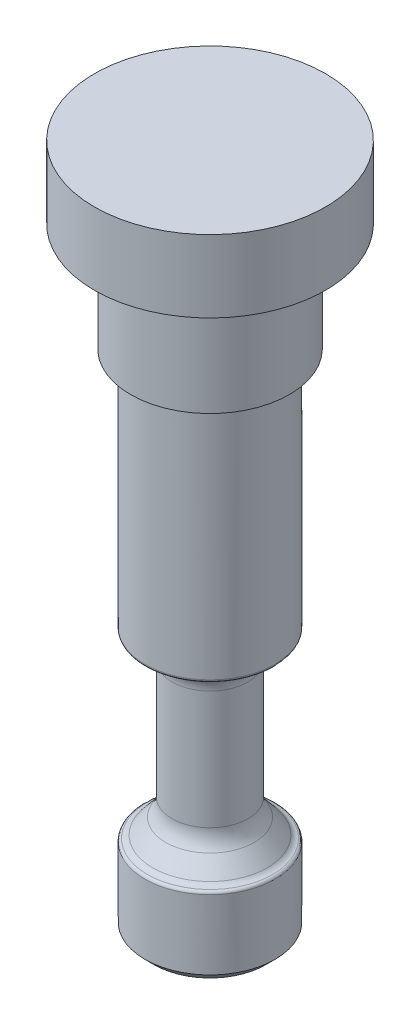
ISO-10303-21;
HEADER;
FILE_DESCRIPTION(('STEP AP214'),'2;1');
FILE_NAME('part.step','',(''),(''),'','','');
FILE_SCHEMA(('AUTOMOTIVE_DESIGN { 1 0 10303 214 1 1 1 1 }'));
ENDSEC;
DATA;
#1=APPLICATION_CONTEXT('core data for automotive mechanical design processes');
#2=APPLICATION_PROTOCOL_DEFINITION('international standard','automotive_design',2000,#1);
#3=PRODUCT_CONTEXT('',#1,'mechanical');
#4=PRODUCT('Part','Part','',(#3));
#5=PRODUCT_RELATED_PRODUCT_CATEGORY('part','',(#4));
#6=PRODUCT_DEFINITION_FORMATION('','',#4);
#7=PRODUCT_DEFINITION_CONTEXT('part definition',#1,'design');
#8=PRODUCT_DEFINITION('design','',#6,#7);
#9=PRODUCT_DEFINITION_SHAPE('','',#8);
#10=(LENGTH_UNIT() NAMED_UNIT(*) SI_UNIT(.MILLI.,.METRE.));
#11=(NAMED_UNIT(*) PLANE_ANGLE_UNIT() SI_UNIT($,.RADIAN.));
#12=(NAMED_UNIT(*) SI_UNIT($,.STERADIAN.) SOLID_ANGLE_UNIT());
#13=UNCERTAINTY_MEASURE_WITH_UNIT(LENGTH_MEASURE(1.E-05),#10,'distance_accuracy_value','');
#14=(GEOMETRIC_REPRESENTATION_CONTEXT(3) GLOBAL_UNCERTAINTY_ASSIGNED_CONTEXT((#13)) GLOBAL_UNIT_ASSIGNED_CONTEXT((#10,
#11,#12)) REPRESENTATION_CONTEXT('',''));
#15=CARTESIAN_POINT('',(0.,0.,0.));
#16=DIRECTION('',(0.,0.,1.));
#17=DIRECTION('',(1.,0.,0.));
#18=AXIS2_PLACEMENT_3D('',#15,#16,#17);
#19=CARTESIAN_POINT('',(0.,44.45,0.));
#20=DIRECTION('',(0.,-1.,0.));
#21=DIRECTION('',(0.,0.,-1.));
#22=AXIS2_PLACEMENT_3D('',#19,#20,#21);
#23=CYLINDRICAL_SURFACE('',#22,5.715);
#24=CARTESIAN_POINT('',(0.,6.90528775559072,0.));
#25=DIRECTION('',(0.,-1.,0.));
#26=DIRECTION('',(0.,0.,-1.));
#27=AXIS2_PLACEMENT_3D('',#24,#25,#26);
#28=CIRCLE('',#27,5.715);
#29=CARTESIAN_POINT('',(0.,6.90528775559072,-5.715));
#30=VERTEX_POINT('',#29);
#31=EDGE_CURVE('E53',#30,#30,#28,.T.);
#32=ORIENTED_EDGE('',*,*,#31,.T.);
#33=EDGE_LOOP('',(#32));
#34=FACE_BOUND('',#33,.T.);
#35=CARTESIAN_POINT('',(0.,0.793750000000003,0.));
#36=DIRECTION('',(0.,1.,0.));
#37=DIRECTION('',(0.,0.,1.));
#38=AXIS2_PLACEMENT_3D('',#35,#36,#37);
#39=CIRCLE('',#38,5.715);
#40=CARTESIAN_POINT('',(0.,0.793750000000003,5.715));
#41=VERTEX_POINT('',#40);
#42=EDGE_CURVE('E62',#41,#41,#39,.T.);
#43=ORIENTED_EDGE('',*,*,#42,.T.);
#44=EDGE_LOOP('',(#43));
#45=FACE_BOUND('',#44,.T.);
#46=ADVANCED_FACE('F33',(#34,#45),#23,.T.);
#47=CARTESIAN_POINT('',(0.,0.,0.));
#48=DIRECTION('',(0.,1.,0.));
#49=DIRECTION('',(0.,0.,1.));
#50=AXIS2_PLACEMENT_3D('',#47,#48,#49);
#51=PLANE('',#50);
#52=CARTESIAN_POINT('',(0.,0.,0.));
#53=DIRECTION('',(0.,1.,0.));
#54=DIRECTION('',(0.,0.,1.));
#55=AXIS2_PLACEMENT_3D('',#52,#53,#54);
#56=CIRCLE('',#55,4.92124999999999);
#57=CARTESIAN_POINT('',(0.,0.,4.92124999999999));
#58=VERTEX_POINT('',#57);
#59=EDGE_CURVE('E59',#58,#58,#56,.F.);
#60=ORIENTED_EDGE('',*,*,#59,.T.);
#61=EDGE_LOOP('',(#60));
#62=FACE_BOUND('',#61,.T.);
#63=ADVANCED_FACE('F109',(#62),#51,.F.);
#64=CARTESIAN_POINT('',(0.,0.793750000000003,0.));
#65=DIRECTION('',(0.,1.,0.));
#66=DIRECTION('',(0.,0.,1.));
#67=AXIS2_PLACEMENT_3D('',#64,#65,#66);
#68=CONICAL_SURFACE('',#67,5.715,0.785398163397452);
#69=ORIENTED_EDGE('',*,*,#59,.F.);
#70=EDGE_LOOP('',(#69));
#71=FACE_BOUND('',#70,.T.);
#72=ORIENTED_EDGE('',*,*,#42,.F.);
#73=EDGE_LOOP('',(#72));
#74=FACE_BOUND('',#73,.T.);
#75=ADVANCED_FACE('F116',(#71,#74),#68,.T.);
#76=CARTESIAN_POINT('',(0.,10.31875,0.));
#77=DIRECTION('',(0.,1.,0.));
#78=DIRECTION('',(0.,0.,1.));
#79=AXIS2_PLACEMENT_3D('',#76,#77,#78);
#80=TOROIDAL_SURFACE('',#79,5.715,2.38125);
#81=CARTESIAN_POINT('',(0.,8.78811200443393,0.));
#82=DIRECTION('',(0.,1.,0.));
#83=DIRECTION('',(0.,0.,1.));
#84=AXIS2_PLACEMENT_3D('',#81,#82,#83);
#85=CIRCLE('',#84,3.89085666982293);
#86=CARTESIAN_POINT('',(0.,8.78811200443393,3.89085666982293));
#87=VERTEX_POINT('',#86);
#88=EDGE_CURVE('E68',#87,#87,#85,.T.);
#89=ORIENTED_EDGE('',*,*,#88,.T.);
#90=EDGE_LOOP('',(#89));
#91=FACE_BOUND('',#90,.T.);
#92=CARTESIAN_POINT('',(0.,10.31875,0.));
#93=DIRECTION('',(0.,1.,0.));
#94=DIRECTION('',(0.,0.,1.));
#95=AXIS2_PLACEMENT_3D('',#92,#93,#94);
#96=CIRCLE('',#95,3.33375);
#97=CARTESIAN_POINT('',(0.,10.31875,3.33375));
#98=VERTEX_POINT('',#97);
#99=EDGE_CURVE('E77',#98,#98,#96,.T.);
#100=ORIENTED_EDGE('',*,*,#99,.F.);
#101=EDGE_LOOP('',(#100));
#102=FACE_BOUND('',#101,.T.);
#103=ADVANCED_FACE('F162',(#91,#102),#80,.F.);
#104=CARTESIAN_POINT('',(0.,8.78811200443393,0.));
#105=DIRECTION('',(0.,-1.,0.));
#106=DIRECTION('',(0.,0.,-1.));
#107=AXIS2_PLACEMENT_3D('',#104,#105,#106);
#108=CONICAL_SURFACE('',#107,3.89085666982293,0.698131700797733);
#109=CARTESIAN_POINT('',(0.,7.42728733481131,0.));
#110=DIRECTION('',(0.,1.,0.));
#111=DIRECTION('',(0.,0.,1.));
#112=AXIS2_PLACEMENT_3D('',#109,#110,#111);
#113=CIRCLE('',#112,5.03272414820022);
#114=CARTESIAN_POINT('',(0.,7.42728733481131,5.03272414820022));
#115=VERTEX_POINT('',#114);
#116=EDGE_CURVE('E71',#115,#115,#113,.T.);
#117=ORIENTED_EDGE('',*,*,#116,.T.);
#118=EDGE_LOOP('',(#117));
#119=FACE_BOUND('',#118,.T.);
#120=ORIENTED_EDGE('',*,*,#88,.F.);
#121=EDGE_LOOP('',(#120));
#122=FACE_BOUND('',#121,.T.);
#123=ADVANCED_FACE('F158',(#119,#122),#108,.T.);
#124=CARTESIAN_POINT('',(0.,7.9375,0.));
#125=DIRECTION('',(0.,1.,0.));
#126=DIRECTION('',(0.,0.,1.));
#127=AXIS2_PLACEMENT_3D('',#124,#125,#126);
#128=TOROIDAL_SURFACE('',#127,5.64077192492591,0.793750000000001);
#129=CARTESIAN_POINT('',(0.,7.15552102696271,0.));
#130=DIRECTION('',(0.,1.,0.));
#131=DIRECTION('',(0.,0.,1.));
#132=AXIS2_PLACEMENT_3D('',#129,#130,#131);
#133=CIRCLE('',#132,5.50458107270932);
#134=CARTESIAN_POINT('',(0.,7.15552102696271,5.50458107270932));
#135=VERTEX_POINT('',#134);
#136=EDGE_CURVE('E56',#135,#135,#133,.T.);
#137=ORIENTED_EDGE('',*,*,#136,.T.);
#138=EDGE_LOOP('',(#137));
#139=FACE_BOUND('',#138,.T.);
#140=ORIENTED_EDGE('',*,*,#116,.F.);
#141=EDGE_LOOP('',(#140));
#142=FACE_BOUND('',#141,.T.);
#143=ADVANCED_FACE('F154',(#139,#142),#128,.F.);
#144=CARTESIAN_POINT('',(0.,20.73275,0.));
#145=DIRECTION('',(0.,1.,0.));
#146=DIRECTION('',(0.,0.,1.));
#147=AXIS2_PLACEMENT_3D('',#144,#145,#146);
#148=TOROIDAL_SURFACE('',#147,5.61975,2.286);
#149=CARTESIAN_POINT('',(0.,23.0142807875142,0.));
#150=DIRECTION('',(0.,-1.,0.));
#151=DIRECTION('',(0.,0.,-1.));
#152=AXIS2_PLACEMENT_3D('',#149,#150,#151);
#153=CIRCLE('',#152,5.476875);
#154=CARTESIAN_POINT('',(0.,23.0142807875142,-5.476875));
#155=VERTEX_POINT('',#154);
#156=EDGE_CURVE('E44',#155,#155,#153,.T.);
#157=ORIENTED_EDGE('',*,*,#156,.T.);
#158=EDGE_LOOP('',(#157));
#159=FACE_BOUND('',#158,.T.);
#160=CARTESIAN_POINT('',(0.,20.73275,0.));
#161=DIRECTION('',(0.,1.,0.));
#162=DIRECTION('',(0.,0.,1.));
#163=AXIS2_PLACEMENT_3D('',#160,#161,#162);
#164=CIRCLE('',#163,3.33375);
#165=CARTESIAN_POINT('',(0.,20.73275,3.33375));
#166=VERTEX_POINT('',#165);
#167=EDGE_CURVE('E74',#166,#166,#164,.T.);
#168=ORIENTED_EDGE('',*,*,#167,.T.);
#169=EDGE_LOOP('',(#168));
#170=FACE_BOUND('',#169,.T.);
#171=ADVANCED_FACE('F132',(#159,#170),#148,.F.);
#172=CARTESIAN_POINT('',(0.,44.45,0.));
#173=DIRECTION('',(0.,1.,0.));
#174=DIRECTION('',(0.,0.,1.));
#175=AXIS2_PLACEMENT_3D('',#172,#173,#174);
#176=CYLINDRICAL_SURFACE('',#175,3.33375);
#177=ORIENTED_EDGE('',*,*,#167,.F.);
#178=EDGE_LOOP('',(#177));
#179=FACE_BOUND('',#178,.T.);
#180=ORIENTED_EDGE('',*,*,#99,.T.);
#181=EDGE_LOOP('',(#180));
#182=FACE_BOUND('',#181,.T.);
#183=ADVANCED_FACE('F123',(#179,#182),#176,.T.);
#184=CARTESIAN_POINT('',(0.,23.2677842083491,0.));
#185=DIRECTION('',(0.,-1.,0.));
#186=DIRECTION('',(0.,0.,-1.));
#187=AXIS2_PLACEMENT_3D('',#184,#185,#186);
#188=CIRCLE('',#187,5.715);
#189=CARTESIAN_POINT('',(0.,23.2677842083491,-5.715));
#190=VERTEX_POINT('',#189);
#191=EDGE_CURVE('E48',#190,#190,#188,.F.);
#192=ORIENTED_EDGE('',*,*,#191,.T.);
#193=EDGE_LOOP('',(#192));
#194=FACE_BOUND('',#193,.T.);
#195=CARTESIAN_POINT('',(0.,44.45,0.));
#196=DIRECTION('',(0.,1.,0.));
#197=DIRECTION('',(0.,0.,1.));
#198=AXIS2_PLACEMENT_3D('',#195,#196,#197);
#199=CIRCLE('',#198,5.715);
#200=CARTESIAN_POINT('',(0.,44.45,5.715));
#201=VERTEX_POINT('',#200);
#202=EDGE_CURVE('E65',#201,#201,#199,.T.);
#203=ORIENTED_EDGE('',*,*,#202,.F.);
#204=EDGE_LOOP('',(#203));
#205=FACE_BOUND('',#204,.T.);
#206=ADVANCED_FACE('F112',(#194,#205),#23,.T.);
#207=CARTESIAN_POINT('',(0.,6.90528775559072,0.));
#208=DIRECTION('',(0.,-1.,0.));
#209=DIRECTION('',(0.,0.,-1.));
#210=AXIS2_PLACEMENT_3D('',#207,#208,#209);
#211=TOROIDAL_SURFACE('',#210,5.461,0.254);
#212=ORIENTED_EDGE('',*,*,#31,.F.);
#213=EDGE_LOOP('',(#212));
#214=FACE_BOUND('',#213,.T.);
#215=ORIENTED_EDGE('',*,*,#136,.F.);
#216=EDGE_LOOP('',(#215));
#217=FACE_BOUND('',#216,.T.);
#218=ADVANCED_FACE('F122',(#214,#217),#211,.T.);
#219=CARTESIAN_POINT('',(0.,23.2677842083491,0.));
#220=DIRECTION('',(0.,-1.,0.));
#221=DIRECTION('',(0.,0.,-1.));
#222=AXIS2_PLACEMENT_3D('',#219,#220,#221);
#223=TOROIDAL_SURFACE('',#222,5.461,0.254);
#224=ORIENTED_EDGE('',*,*,#156,.F.);
#225=EDGE_LOOP('',(#224));
#226=FACE_BOUND('',#225,.T.);
#227=ORIENTED_EDGE('',*,*,#191,.F.);
#228=EDGE_LOOP('',(#227));
#229=FACE_BOUND('',#228,.T.);
#230=ADVANCED_FACE('F129',(#226,#229),#223,.T.);
#231=CARTESIAN_POINT('',(0.,53.975,0.));
#232=DIRECTION('',(0.,-1.,0.));
#233=DIRECTION('',(0.,0.,-1.));
#234=AXIS2_PLACEMENT_3D('',#231,#232,#233);
#235=CYLINDRICAL_SURFACE('',#234,6.985);
#236=CARTESIAN_POINT('',(0.,52.705,0.));
#237=DIRECTION('',(0.,1.,0.));
#238=DIRECTION('',(0.,0.,1.));
#239=AXIS2_PLACEMENT_3D('',#236,#237,#238);
#240=CIRCLE('',#239,6.985);
#241=CARTESIAN_POINT('',(0.,52.705,6.985));
#242=VERTEX_POINT('',#241);
#243=EDGE_CURVE('E10',#242,#242,#240,.F.);
#244=ORIENTED_EDGE('',*,*,#243,.T.);
#245=EDGE_LOOP('',(#244));
#246=FACE_BOUND('',#245,.T.);
#247=CARTESIAN_POINT('',(0.,44.45,0.));
#248=DIRECTION('',(0.,1.,0.));
#249=DIRECTION('',(0.,0.,1.));
#250=AXIS2_PLACEMENT_3D('',#247,#248,#249);
#251=CIRCLE('',#250,6.985);
#252=CARTESIAN_POINT('',(0.,44.45,6.985));
#253=VERTEX_POINT('',#252);
#254=EDGE_CURVE('E80',#253,#253,#251,.T.);
#255=ORIENTED_EDGE('',*,*,#254,.T.);
#256=EDGE_LOOP('',(#255));
#257=FACE_BOUND('',#256,.T.);
#258=ADVANCED_FACE('F141',(#246,#257),#235,.T.);
#259=CARTESIAN_POINT('',(0.,44.45,0.));
#260=DIRECTION('',(0.,1.,0.));
#261=DIRECTION('',(0.,0.,1.));
#262=AXIS2_PLACEMENT_3D('',#259,#260,#261);
#263=PLANE('',#262);
#264=ORIENTED_EDGE('',*,*,#202,.T.);
#265=EDGE_LOOP('',(#264));
#266=FACE_BOUND('',#265,.T.);
#267=ORIENTED_EDGE('',*,*,#254,.F.);
#268=EDGE_LOOP('',(#267));
#269=FACE_BOUND('',#268,.T.);
#270=ADVANCED_FACE('F95',(#266,#269),#263,.F.);
#271=CARTESIAN_POINT('',(0.,60.325,0.));
#272=DIRECTION('',(0.,-1.,0.));
#273=DIRECTION('',(0.,0.,-1.));
#274=AXIS2_PLACEMENT_3D('',#271,#272,#273);
#275=CYLINDRICAL_SURFACE('',#274,10.16);
#276=CARTESIAN_POINT('',(0.,60.325,0.));
#277=DIRECTION('',(0.,1.,0.));
#278=DIRECTION('',(0.,0.,1.));
#279=AXIS2_PLACEMENT_3D('',#276,#277,#278);
#280=CIRCLE('',#279,10.16);
#281=CARTESIAN_POINT('',(0.,60.325,10.16));
#282=VERTEX_POINT('',#281);
#283=EDGE_CURVE('E83',#282,#282,#280,.T.);
#284=ORIENTED_EDGE('',*,*,#283,.F.);
#285=EDGE_LOOP('',(#284));
#286=FACE_BOUND('',#285,.T.);
#287=CARTESIAN_POINT('',(0.,53.975,0.));
#288=DIRECTION('',(0.,1.,0.));
#289=DIRECTION('',(0.,0.,1.));
#290=AXIS2_PLACEMENT_3D('',#287,#288,#289);
#291=CIRCLE('',#290,10.16);
#292=CARTESIAN_POINT('',(0.,53.975,10.16));
#293=VERTEX_POINT('',#292);
#294=EDGE_CURVE('E84',#293,#293,#291,.T.);
#295=ORIENTED_EDGE('',*,*,#294,.T.);
#296=EDGE_LOOP('',(#295));
#297=FACE_BOUND('',#296,.T.);
#298=ADVANCED_FACE('F92',(#286,#297),#275,.T.);
#299=CARTESIAN_POINT('',(0.,60.325,0.));
#300=DIRECTION('',(0.,1.,0.));
#301=DIRECTION('',(0.,0.,1.));
#302=AXIS2_PLACEMENT_3D('',#299,#300,#301);
#303=PLANE('',#302);
#304=ORIENTED_EDGE('',*,*,#283,.T.);
#305=EDGE_LOOP('',(#304));
#306=FACE_BOUND('',#305,.T.);
#307=ADVANCED_FACE('F90',(#306),#303,.T.);
#308=CARTESIAN_POINT('',(0.,53.975,0.));
#309=DIRECTION('',(0.,1.,0.));
#310=DIRECTION('',(0.,0.,1.));
#311=AXIS2_PLACEMENT_3D('',#308,#309,#310);
#312=PLANE('',#311);
#313=CARTESIAN_POINT('',(0.,53.975,0.));
#314=DIRECTION('',(0.,1.,0.));
#315=DIRECTION('',(0.,0.,1.));
#316=AXIS2_PLACEMENT_3D('',#313,#314,#315);
#317=CIRCLE('',#316,8.255);
#318=CARTESIAN_POINT('',(0.,53.975,8.255));
#319=VERTEX_POINT('',#318);
#320=EDGE_CURVE('E40',#319,#319,#317,.T.);
#321=ORIENTED_EDGE('',*,*,#320,.T.);
#322=EDGE_LOOP('',(#321));
#323=FACE_BOUND('',#322,.T.);
#324=ORIENTED_EDGE('',*,*,#294,.F.);
#325=EDGE_LOOP('',(#324));
#326=FACE_BOUND('',#325,.T.);
#327=ADVANCED_FACE('F99',(#323,#326),#312,.F.);
#328=CARTESIAN_POINT('',(0.,52.705,0.));
#329=DIRECTION('',(0.,1.,0.));
#330=DIRECTION('',(0.,0.,1.));
#331=AXIS2_PLACEMENT_3D('',#328,#329,#330);
#332=TOROIDAL_SURFACE('',#331,8.255,1.27);
#333=ORIENTED_EDGE('',*,*,#243,.F.);
#334=EDGE_LOOP('',(#333));
#335=FACE_BOUND('',#334,.T.);
#336=ORIENTED_EDGE('',*,*,#320,.F.);
#337=EDGE_LOOP('',(#336));
#338=FACE_BOUND('',#337,.T.);
#339=ADVANCED_FACE('F35',(#335,#338),#332,.F.);
#340=CLOSED_SHELL('',(#46,#63,#75,#103,#123,#143,#171,#183,#206,#218,#230,#258,#270,#298,#307,
#327,#339));
#341=MANIFOLD_SOLID_BREP('B2',#340);
#342=ADVANCED_BREP_SHAPE_REPRESENTATION('',(#18,#341),#14);
#343=SHAPE_DEFINITION_REPRESENTATION(#9,#342);
ENDSEC;
END-ISO-10303-21;
